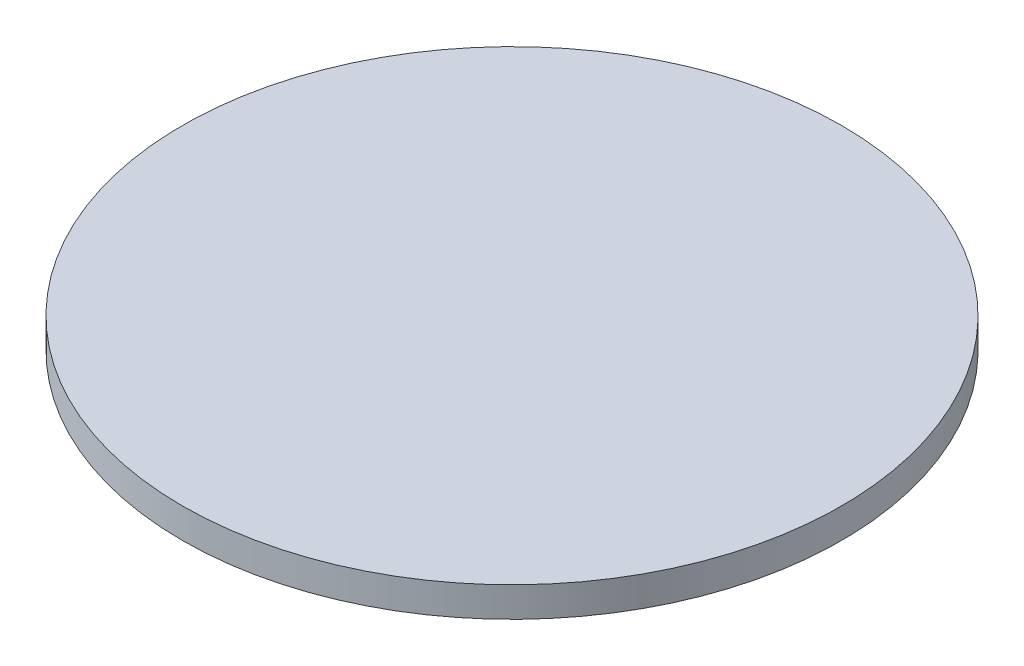
ISO-10303-21;
HEADER;
FILE_DESCRIPTION(('STEP AP214'),'2;1');
FILE_NAME('part.step','',(''),(''),'','','');
FILE_SCHEMA(('AUTOMOTIVE_DESIGN { 1 0 10303 214 1 1 1 1 }'));
ENDSEC;
DATA;
#1=APPLICATION_CONTEXT('core data for automotive mechanical design processes');
#2=APPLICATION_PROTOCOL_DEFINITION('international standard','automotive_design',2000,#1);
#3=PRODUCT_CONTEXT('',#1,'mechanical');
#4=PRODUCT('Part','Part','',(#3));
#5=PRODUCT_RELATED_PRODUCT_CATEGORY('part','',(#4));
#6=PRODUCT_DEFINITION_FORMATION('','',#4);
#7=PRODUCT_DEFINITION_CONTEXT('part definition',#1,'design');
#8=PRODUCT_DEFINITION('design','',#6,#7);
#9=PRODUCT_DEFINITION_SHAPE('','',#8);
#10=(LENGTH_UNIT() NAMED_UNIT(*) SI_UNIT(.MILLI.,.METRE.));
#11=(NAMED_UNIT(*) PLANE_ANGLE_UNIT() SI_UNIT($,.RADIAN.));
#12=(NAMED_UNIT(*) SI_UNIT($,.STERADIAN.) SOLID_ANGLE_UNIT());
#13=UNCERTAINTY_MEASURE_WITH_UNIT(LENGTH_MEASURE(1.E-05),#10,'distance_accuracy_value','');
#14=(GEOMETRIC_REPRESENTATION_CONTEXT(3) GLOBAL_UNCERTAINTY_ASSIGNED_CONTEXT((#13)) GLOBAL_UNIT_ASSIGNED_CONTEXT((#10,
#11,#12)) REPRESENTATION_CONTEXT('',''));
#15=CARTESIAN_POINT('',(0.,0.,0.));
#16=DIRECTION('',(0.,0.,1.));
#17=DIRECTION('',(1.,0.,0.));
#18=AXIS2_PLACEMENT_3D('',#15,#16,#17);
#19=CARTESIAN_POINT('',(0.,1.,0.));
#20=DIRECTION('',(0.,-1.,0.));
#21=DIRECTION('',(0.,0.,-1.));
#22=AXIS2_PLACEMENT_3D('',#19,#20,#21);
#23=CYLINDRICAL_SURFACE('',#22,11.);
#24=CARTESIAN_POINT('',(0.,1.,0.));
#25=DIRECTION('',(0.,1.,0.));
#26=DIRECTION('',(0.,0.,1.));
#27=AXIS2_PLACEMENT_3D('',#24,#25,#26);
#28=CIRCLE('',#27,11.);
#29=CARTESIAN_POINT('',(0.,1.,11.));
#30=VERTEX_POINT('',#29);
#31=EDGE_CURVE('E41',#30,#30,#28,.T.);
#32=ORIENTED_EDGE('',*,*,#31,.F.);
#33=EDGE_LOOP('',(#32));
#34=FACE_BOUND('',#33,.T.);
#35=CARTESIAN_POINT('',(0.,0.,0.));
#36=DIRECTION('',(0.,1.,0.));
#37=DIRECTION('',(0.,0.,1.));
#38=AXIS2_PLACEMENT_3D('',#35,#36,#37);
#39=CIRCLE('',#38,11.);
#40=CARTESIAN_POINT('',(0.,0.,11.));
#41=VERTEX_POINT('',#40);
#42=EDGE_CURVE('E45',#41,#41,#39,.T.);
#43=ORIENTED_EDGE('',*,*,#42,.T.);
#44=EDGE_LOOP('',(#43));
#45=FACE_BOUND('',#44,.T.);
#46=ADVANCED_FACE('F35',(#34,#45),#23,.T.);
#47=CARTESIAN_POINT('',(0.,1.,0.));
#48=DIRECTION('',(0.,1.,0.));
#49=DIRECTION('',(0.,0.,1.));
#50=AXIS2_PLACEMENT_3D('',#47,#48,#49);
#51=PLANE('',#50);
#52=ORIENTED_EDGE('',*,*,#31,.T.);
#53=EDGE_LOOP('',(#52));
#54=FACE_BOUND('',#53,.T.);
#55=ADVANCED_FACE('F66',(#54),#51,.T.);
#56=CARTESIAN_POINT('',(0.,0.,0.));
#57=DIRECTION('',(0.,1.,0.));
#58=DIRECTION('',(0.,0.,1.));
#59=AXIS2_PLACEMENT_3D('',#56,#57,#58);
#60=PLANE('',#59);
#61=CARTESIAN_POINT('',(0.,0.,0.));
#62=DIRECTION('',(0.,1.,0.));
#63=DIRECTION('',(0.,0.,1.));
#64=AXIS2_PLACEMENT_3D('',#61,#62,#63);
#65=CIRCLE('',#64,0.5);
#66=CARTESIAN_POINT('',(0.,0.,0.5));
#67=VERTEX_POINT('',#66);
#68=EDGE_CURVE('E10',#67,#67,#65,.F.);
#69=ORIENTED_EDGE('',*,*,#68,.F.);
#70=EDGE_LOOP('',(#69));
#71=FACE_BOUND('',#70,.T.);
#72=ORIENTED_EDGE('',*,*,#42,.F.);
#73=EDGE_LOOP('',(#72));
#74=FACE_BOUND('',#73,.T.);
#75=ADVANCED_FACE('F59',(#71,#74),#60,.F.);
#76=CARTESIAN_POINT('',(0.,-2.5,0.));
#77=DIRECTION('',(0.,1.,0.));
#78=DIRECTION('',(0.,0.,1.));
#79=AXIS2_PLACEMENT_3D('',#76,#77,#78);
#80=CYLINDRICAL_SURFACE('',#79,0.5);
#81=CARTESIAN_POINT('',(0.,-2.5,0.));
#82=DIRECTION('',(0.,-1.,0.));
#83=DIRECTION('',(0.,0.,-1.));
#84=AXIS2_PLACEMENT_3D('',#81,#82,#83);
#85=CIRCLE('',#84,0.5);
#86=CARTESIAN_POINT('',(0.,-2.5,-0.5));
#87=VERTEX_POINT('',#86);
#88=EDGE_CURVE('E50',#87,#87,#85,.T.);
#89=ORIENTED_EDGE('',*,*,#88,.F.);
#90=EDGE_LOOP('',(#89));
#91=FACE_BOUND('',#90,.T.);
#92=ORIENTED_EDGE('',*,*,#68,.T.);
#93=EDGE_LOOP('',(#92));
#94=FACE_BOUND('',#93,.T.);
#95=ADVANCED_FACE('F57',(#91,#94),#80,.T.);
#96=CARTESIAN_POINT('',(0.,-2.5,0.));
#97=DIRECTION('',(0.,-1.,0.));
#98=DIRECTION('',(0.,0.,-1.));
#99=AXIS2_PLACEMENT_3D('',#96,#97,#98);
#100=PLANE('',#99);
#101=ORIENTED_EDGE('',*,*,#88,.T.);
#102=EDGE_LOOP('',(#101));
#103=FACE_BOUND('',#102,.T.);
#104=ADVANCED_FACE('F55',(#103),#100,.T.);
#105=CLOSED_SHELL('',(#46,#55,#75,#95,#104));
#106=MANIFOLD_SOLID_BREP('B2',#105);
#107=ADVANCED_BREP_SHAPE_REPRESENTATION('',(#18,#106),#14);
#108=SHAPE_DEFINITION_REPRESENTATION(#9,#107);
ENDSEC;
END-ISO-10303-21;
